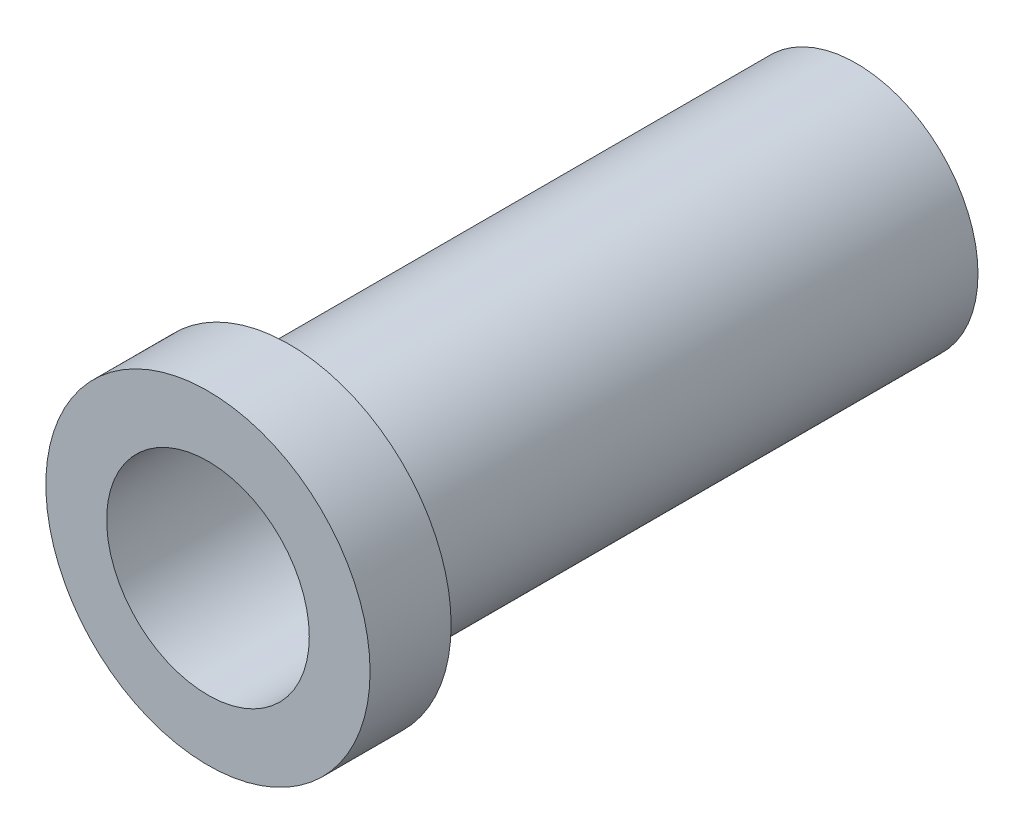
ISO-10303-21;
HEADER;
FILE_DESCRIPTION(('STEP AP214'),'2;1');
FILE_NAME('part.step','',(''),(''),'','','');
FILE_SCHEMA(('AUTOMOTIVE_DESIGN { 1 0 10303 214 1 1 1 1 }'));
ENDSEC;
DATA;
#1=APPLICATION_CONTEXT('core data for automotive mechanical design processes');
#2=APPLICATION_PROTOCOL_DEFINITION('international standard','automotive_design',2000,#1);
#3=PRODUCT_CONTEXT('',#1,'mechanical');
#4=PRODUCT('Part','Part','',(#3));
#5=PRODUCT_RELATED_PRODUCT_CATEGORY('part','',(#4));
#6=PRODUCT_DEFINITION_FORMATION('','',#4);
#7=PRODUCT_DEFINITION_CONTEXT('part definition',#1,'design');
#8=PRODUCT_DEFINITION('design','',#6,#7);
#9=PRODUCT_DEFINITION_SHAPE('','',#8);
#10=(LENGTH_UNIT() NAMED_UNIT(*) SI_UNIT(.MILLI.,.METRE.));
#11=(NAMED_UNIT(*) PLANE_ANGLE_UNIT() SI_UNIT($,.RADIAN.));
#12=(NAMED_UNIT(*) SI_UNIT($,.STERADIAN.) SOLID_ANGLE_UNIT());
#13=UNCERTAINTY_MEASURE_WITH_UNIT(LENGTH_MEASURE(1.E-05),#10,'distance_accuracy_value','');
#14=(GEOMETRIC_REPRESENTATION_CONTEXT(3) GLOBAL_UNCERTAINTY_ASSIGNED_CONTEXT((#13)) GLOBAL_UNIT_ASSIGNED_CONTEXT((#10,
#11,#12)) REPRESENTATION_CONTEXT('',''));
#15=CARTESIAN_POINT('',(0.,0.,0.));
#16=DIRECTION('',(0.,0.,1.));
#17=DIRECTION('',(1.,0.,0.));
#18=AXIS2_PLACEMENT_3D('',#15,#16,#17);
#19=CARTESIAN_POINT('',(0.,0.,101.6));
#20=DIRECTION('',(0.,0.,-1.));
#21=DIRECTION('',(-1.,0.,0.));
#22=AXIS2_PLACEMENT_3D('',#19,#20,#21);
#23=CYLINDRICAL_SURFACE('',#22,19.05);
#24=CARTESIAN_POINT('',(0.,0.,0.));
#25=DIRECTION('',(0.,0.,1.));
#26=DIRECTION('',(1.,0.,0.));
#27=AXIS2_PLACEMENT_3D('',#24,#25,#26);
#28=CIRCLE('',#27,19.05);
#29=CARTESIAN_POINT('',(19.05,0.,0.));
#30=VERTEX_POINT('',#29);
#31=EDGE_CURVE('E33',#30,#30,#28,.T.);
#32=ORIENTED_EDGE('',*,*,#31,.T.);
#33=EDGE_LOOP('',(#32));
#34=FACE_BOUND('',#33,.T.);
#35=CARTESIAN_POINT('',(0.,0.,88.9));
#36=DIRECTION('',(0.,0.,1.));
#37=DIRECTION('',(1.,0.,0.));
#38=AXIS2_PLACEMENT_3D('',#35,#36,#37);
#39=CIRCLE('',#38,19.05);
#40=CARTESIAN_POINT('',(19.05,0.,88.9));
#41=VERTEX_POINT('',#40);
#42=EDGE_CURVE('E10',#41,#41,#39,.T.);
#43=ORIENTED_EDGE('',*,*,#42,.F.);
#44=EDGE_LOOP('',(#43));
#45=FACE_BOUND('',#44,.T.);
#46=ADVANCED_FACE('F30',(#34,#45),#23,.T.);
#47=CARTESIAN_POINT('',(0.,0.,0.));
#48=DIRECTION('',(0.,0.,1.));
#49=DIRECTION('',(1.,0.,0.));
#50=AXIS2_PLACEMENT_3D('',#47,#48,#49);
#51=CYLINDRICAL_SURFACE('',#50,15.875);
#52=CARTESIAN_POINT('',(0.,0.,0.));
#53=DIRECTION('',(0.,0.,1.));
#54=DIRECTION('',(1.,0.,0.));
#55=AXIS2_PLACEMENT_3D('',#52,#53,#54);
#56=CIRCLE('',#55,15.875);
#57=CARTESIAN_POINT('',(15.875,0.,0.));
#58=VERTEX_POINT('',#57);
#59=EDGE_CURVE('E41',#58,#58,#56,.T.);
#60=ORIENTED_EDGE('',*,*,#59,.F.);
#61=EDGE_LOOP('',(#60));
#62=FACE_BOUND('',#61,.T.);
#63=CARTESIAN_POINT('',(0.,0.,101.6));
#64=DIRECTION('',(0.,0.,1.));
#65=DIRECTION('',(1.,0.,0.));
#66=AXIS2_PLACEMENT_3D('',#63,#64,#65);
#67=CIRCLE('',#66,15.875);
#68=CARTESIAN_POINT('',(15.875,0.,101.6));
#69=VERTEX_POINT('',#68);
#70=EDGE_CURVE('E53',#69,#69,#67,.T.);
#71=ORIENTED_EDGE('',*,*,#70,.T.);
#72=EDGE_LOOP('',(#71));
#73=FACE_BOUND('',#72,.T.);
#74=ADVANCED_FACE('F58',(#62,#73),#51,.F.);
#75=CARTESIAN_POINT('',(0.,0.,0.));
#76=DIRECTION('',(0.,0.,1.));
#77=DIRECTION('',(1.,0.,0.));
#78=AXIS2_PLACEMENT_3D('',#75,#76,#77);
#79=PLANE('',#78);
#80=ORIENTED_EDGE('',*,*,#59,.T.);
#81=EDGE_LOOP('',(#80));
#82=FACE_BOUND('',#81,.T.);
#83=ORIENTED_EDGE('',*,*,#31,.F.);
#84=EDGE_LOOP('',(#83));
#85=FACE_BOUND('',#84,.T.);
#86=ADVANCED_FACE('F73',(#82,#85),#79,.F.);
#87=CARTESIAN_POINT('',(0.,0.,88.9));
#88=DIRECTION('',(0.,0.,1.));
#89=DIRECTION('',(1.,0.,0.));
#90=AXIS2_PLACEMENT_3D('',#87,#88,#89);
#91=PLANE('',#90);
#92=CARTESIAN_POINT('',(0.,0.,88.9));
#93=DIRECTION('',(0.,0.,1.));
#94=DIRECTION('',(1.,0.,0.));
#95=AXIS2_PLACEMENT_3D('',#92,#93,#94);
#96=CIRCLE('',#95,25.4);
#97=CARTESIAN_POINT('',(25.4,0.,88.9));
#98=VERTEX_POINT('',#97);
#99=EDGE_CURVE('E46',#98,#98,#96,.T.);
#100=ORIENTED_EDGE('',*,*,#99,.F.);
#101=EDGE_LOOP('',(#100));
#102=FACE_BOUND('',#101,.T.);
#103=ORIENTED_EDGE('',*,*,#42,.T.);
#104=EDGE_LOOP('',(#103));
#105=FACE_BOUND('',#104,.T.);
#106=ADVANCED_FACE('F68',(#102,#105),#91,.F.);
#107=CARTESIAN_POINT('',(0.,0.,88.9));
#108=DIRECTION('',(0.,0.,1.));
#109=DIRECTION('',(1.,0.,0.));
#110=AXIS2_PLACEMENT_3D('',#107,#108,#109);
#111=CYLINDRICAL_SURFACE('',#110,25.4);
#112=ORIENTED_EDGE('',*,*,#99,.T.);
#113=EDGE_LOOP('',(#112));
#114=FACE_BOUND('',#113,.T.);
#115=CARTESIAN_POINT('',(0.,0.,101.6));
#116=DIRECTION('',(0.,0.,1.));
#117=DIRECTION('',(1.,0.,0.));
#118=AXIS2_PLACEMENT_3D('',#115,#116,#117);
#119=CIRCLE('',#118,25.4);
#120=CARTESIAN_POINT('',(25.4,0.,101.6));
#121=VERTEX_POINT('',#120);
#122=EDGE_CURVE('E43',#121,#121,#119,.T.);
#123=ORIENTED_EDGE('',*,*,#122,.F.);
#124=EDGE_LOOP('',(#123));
#125=FACE_BOUND('',#124,.T.);
#126=ADVANCED_FACE('F63',(#114,#125),#111,.T.);
#127=CARTESIAN_POINT('',(0.,0.,101.6));
#128=DIRECTION('',(0.,0.,1.));
#129=DIRECTION('',(1.,0.,0.));
#130=AXIS2_PLACEMENT_3D('',#127,#128,#129);
#131=PLANE('',#130);
#132=ORIENTED_EDGE('',*,*,#70,.F.);
#133=EDGE_LOOP('',(#132));
#134=FACE_BOUND('',#133,.T.);
#135=ORIENTED_EDGE('',*,*,#122,.T.);
#136=EDGE_LOOP('',(#135));
#137=FACE_BOUND('',#136,.T.);
#138=ADVANCED_FACE('F60',(#134,#137),#131,.T.);
#139=CLOSED_SHELL('',(#46,#74,#86,#106,#126,#138));
#140=MANIFOLD_SOLID_BREP('B2',#139);
#141=ADVANCED_BREP_SHAPE_REPRESENTATION('',(#18,#140),#14);
#142=SHAPE_DEFINITION_REPRESENTATION(#9,#141);
ENDSEC;
END-ISO-10303-21;
